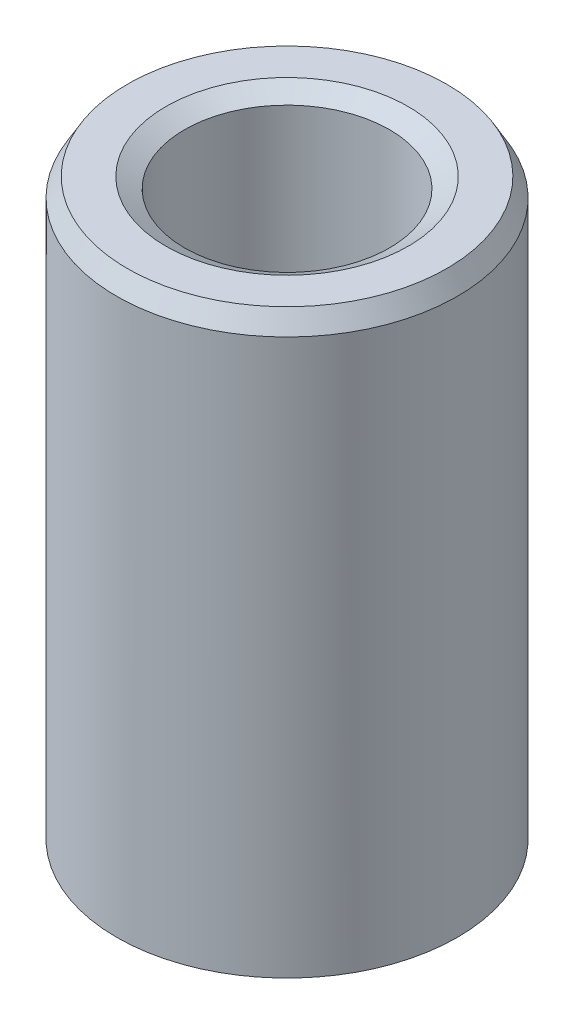
ISO-10303-21;
HEADER;
FILE_DESCRIPTION(('STEP AP214'),'2;1');
FILE_NAME('part.step','',(''),(''),'','','');
FILE_SCHEMA(('AUTOMOTIVE_DESIGN { 1 0 10303 214 1 1 1 1 }'));
ENDSEC;
DATA;
#1=APPLICATION_CONTEXT('core data for automotive mechanical design processes');
#2=APPLICATION_PROTOCOL_DEFINITION('international standard','automotive_design',2000,#1);
#3=PRODUCT_CONTEXT('',#1,'mechanical');
#4=PRODUCT('Part','Part','',(#3));
#5=PRODUCT_RELATED_PRODUCT_CATEGORY('part','',(#4));
#6=PRODUCT_DEFINITION_FORMATION('','',#4);
#7=PRODUCT_DEFINITION_CONTEXT('part definition',#1,'design');
#8=PRODUCT_DEFINITION('design','',#6,#7);
#9=PRODUCT_DEFINITION_SHAPE('','',#8);
#10=(LENGTH_UNIT() NAMED_UNIT(*) SI_UNIT(.MILLI.,.METRE.));
#11=(NAMED_UNIT(*) PLANE_ANGLE_UNIT() SI_UNIT($,.RADIAN.));
#12=(NAMED_UNIT(*) SI_UNIT($,.STERADIAN.) SOLID_ANGLE_UNIT());
#13=UNCERTAINTY_MEASURE_WITH_UNIT(LENGTH_MEASURE(1.E-05),#10,'distance_accuracy_value','');
#14=(GEOMETRIC_REPRESENTATION_CONTEXT(3) GLOBAL_UNCERTAINTY_ASSIGNED_CONTEXT((#13)) GLOBAL_UNIT_ASSIGNED_CONTEXT((#10,
#11,#12)) REPRESENTATION_CONTEXT('',''));
#15=CARTESIAN_POINT('',(0.,0.,0.));
#16=DIRECTION('',(0.,0.,1.));
#17=DIRECTION('',(1.,0.,0.));
#18=AXIS2_PLACEMENT_3D('',#15,#16,#17);
#19=CARTESIAN_POINT('',(0.,111.46514379659,0.));
#20=DIRECTION('',(0.,-1.,0.));
#21=DIRECTION('',(0.,0.,-1.));
#22=AXIS2_PLACEMENT_3D('',#19,#20,#21);
#23=CYLINDRICAL_SURFACE('',#22,32.5);
#24=CARTESIAN_POINT('',(0.,2.04900109820265,0.));
#25=DIRECTION('',(0.,1.,0.));
#26=DIRECTION('',(0.,0.,1.));
#27=AXIS2_PLACEMENT_3D('',#24,#25,#26);
#28=CIRCLE('',#27,32.5);
#29=CARTESIAN_POINT('',(0.,2.04900109820265,32.5));
#30=VERTEX_POINT('',#29);
#31=EDGE_CURVE('E10',#30,#30,#28,.T.);
#32=ORIENTED_EDGE('',*,*,#31,.T.);
#33=EDGE_LOOP('',(#32));
#34=FACE_BOUND('',#33,.T.);
#35=CARTESIAN_POINT('',(0.,107.916169789739,0.));
#36=DIRECTION('',(0.,1.,0.));
#37=DIRECTION('',(0.,0.,1.));
#38=AXIS2_PLACEMENT_3D('',#35,#36,#37);
#39=CIRCLE('',#38,32.5);
#40=CARTESIAN_POINT('',(0.,107.916169789739,-32.5));
#41=VERTEX_POINT('',#40);
#42=EDGE_CURVE('E50',#41,#41,#39,.F.);
#43=ORIENTED_EDGE('',*,*,#42,.T.);
#44=EDGE_LOOP('',(#43));
#45=FACE_BOUND('',#44,.T.);
#46=ADVANCED_FACE('F39',(#34,#45),#23,.T.);
#47=CARTESIAN_POINT('',(0.,111.46514379659,0.));
#48=DIRECTION('',(0.,1.,0.));
#49=DIRECTION('',(0.,0.,1.));
#50=AXIS2_PLACEMENT_3D('',#47,#48,#49);
#51=PLANE('',#50);
#52=CARTESIAN_POINT('',(0.,111.46514379659,0.));
#53=DIRECTION('',(0.,1.,0.));
#54=DIRECTION('',(0.,0.,1.));
#55=AXIS2_PLACEMENT_3D('',#52,#53,#54);
#56=CIRCLE('',#55,23.0939143873798);
#57=CARTESIAN_POINT('',(0.,111.46514379659,23.0939143873798));
#58=VERTEX_POINT('',#57);
#59=EDGE_CURVE('E58',#58,#58,#56,.F.);
#60=ORIENTED_EDGE('',*,*,#59,.T.);
#61=EDGE_LOOP('',(#60));
#62=FACE_BOUND('',#61,.T.);
#63=CARTESIAN_POINT('',(0.,111.46514379659,0.));
#64=DIRECTION('',(0.,1.,0.));
#65=DIRECTION('',(0.,0.,1.));
#66=AXIS2_PLACEMENT_3D('',#63,#64,#65);
#67=CIRCLE('',#66,30.4509989017974);
#68=CARTESIAN_POINT('',(0.,111.46514379659,-30.4509989017974));
#69=VERTEX_POINT('',#68);
#70=EDGE_CURVE('E61',#69,#69,#67,.T.);
#71=ORIENTED_EDGE('',*,*,#70,.T.);
#72=EDGE_LOOP('',(#71));
#73=FACE_BOUND('',#72,.T.);
#74=ADVANCED_FACE('F88',(#62,#73),#51,.T.);
#75=CARTESIAN_POINT('',(0.,0.,0.));
#76=DIRECTION('',(0.,1.,0.));
#77=DIRECTION('',(0.,0.,1.));
#78=AXIS2_PLACEMENT_3D('',#75,#76,#77);
#79=PLANE('',#78);
#80=CARTESIAN_POINT('',(0.,0.,0.));
#81=DIRECTION('',(0.,1.,0.));
#82=DIRECTION('',(0.,0.,1.));
#83=AXIS2_PLACEMENT_3D('',#80,#81,#82);
#84=CIRCLE('',#83,21.5939414787309);
#85=CARTESIAN_POINT('',(0.,0.,21.5939414787309));
#86=VERTEX_POINT('',#85);
#87=EDGE_CURVE('E51',#86,#86,#84,.T.);
#88=ORIENTED_EDGE('',*,*,#87,.T.);
#89=EDGE_LOOP('',(#88));
#90=FACE_BOUND('',#89,.T.);
#91=CARTESIAN_POINT('',(0.,0.,0.));
#92=DIRECTION('',(0.,1.,0.));
#93=DIRECTION('',(0.,0.,1.));
#94=AXIS2_PLACEMENT_3D('',#91,#92,#93);
#95=CIRCLE('',#94,28.9510259931486);
#96=CARTESIAN_POINT('',(0.,0.,28.9510259931486));
#97=VERTEX_POINT('',#96);
#98=EDGE_CURVE('E54',#97,#97,#95,.F.);
#99=ORIENTED_EDGE('',*,*,#98,.T.);
#100=EDGE_LOOP('',(#99));
#101=FACE_BOUND('',#100,.T.);
#102=ADVANCED_FACE('F83',(#90,#101),#79,.F.);
#103=CARTESIAN_POINT('',(0.,111.46514379659,0.));
#104=DIRECTION('',(0.,-1.,0.));
#105=DIRECTION('',(0.,0.,-1.));
#106=AXIS2_PLACEMENT_3D('',#103,#104,#105);
#107=CYLINDRICAL_SURFACE('',#106,19.5449403805283);
#108=CARTESIAN_POINT('',(0.,109.416142698387,0.));
#109=DIRECTION('',(0.,1.,0.));
#110=DIRECTION('',(0.,0.,1.));
#111=AXIS2_PLACEMENT_3D('',#108,#109,#110);
#112=CIRCLE('',#111,19.5449403805283);
#113=CARTESIAN_POINT('',(0.,109.416142698387,19.5449403805283));
#114=VERTEX_POINT('',#113);
#115=EDGE_CURVE('E67',#114,#114,#112,.T.);
#116=ORIENTED_EDGE('',*,*,#115,.T.);
#117=EDGE_LOOP('',(#116));
#118=FACE_BOUND('',#117,.T.);
#119=CARTESIAN_POINT('',(0.,3.54897400685143,0.));
#120=DIRECTION('',(0.,1.,0.));
#121=DIRECTION('',(0.,0.,1.));
#122=AXIS2_PLACEMENT_3D('',#119,#120,#121);
#123=CIRCLE('',#122,19.5449403805283);
#124=CARTESIAN_POINT('',(0.,3.54897400685143,19.5449403805283));
#125=VERTEX_POINT('',#124);
#126=EDGE_CURVE('E69',#125,#125,#123,.F.);
#127=ORIENTED_EDGE('',*,*,#126,.T.);
#128=EDGE_LOOP('',(#127));
#129=FACE_BOUND('',#128,.T.);
#130=ADVANCED_FACE('F71',(#118,#129),#107,.F.);
#131=CARTESIAN_POINT('',(0.,109.416142698387,0.));
#132=DIRECTION('',(0.,1.,0.));
#133=DIRECTION('',(0.,0.,1.));
#134=AXIS2_PLACEMENT_3D('',#131,#132,#133);
#135=CONICAL_SURFACE('',#134,19.5449403805283,1.0471975511966);
#136=ORIENTED_EDGE('',*,*,#59,.F.);
#137=EDGE_LOOP('',(#136));
#138=FACE_BOUND('',#137,.T.);
#139=ORIENTED_EDGE('',*,*,#115,.F.);
#140=EDGE_LOOP('',(#139));
#141=FACE_BOUND('',#140,.T.);
#142=ADVANCED_FACE('F77',(#138,#141),#135,.F.);
#143=CARTESIAN_POINT('',(0.,0.,0.));
#144=DIRECTION('',(0.,-1.,0.));
#145=DIRECTION('',(0.,0.,-1.));
#146=AXIS2_PLACEMENT_3D('',#143,#144,#145);
#147=CONICAL_SURFACE('',#146,21.5939414787309,0.523598775598295);
#148=ORIENTED_EDGE('',*,*,#126,.F.);
#149=EDGE_LOOP('',(#148));
#150=FACE_BOUND('',#149,.T.);
#151=ORIENTED_EDGE('',*,*,#87,.F.);
#152=EDGE_LOOP('',(#151));
#153=FACE_BOUND('',#152,.T.);
#154=ADVANCED_FACE('F73',(#150,#153),#147,.F.);
#155=CARTESIAN_POINT('',(0.,2.04900109820265,0.));
#156=DIRECTION('',(0.,1.,0.));
#157=DIRECTION('',(0.,0.,1.));
#158=AXIS2_PLACEMENT_3D('',#155,#156,#157);
#159=CONICAL_SURFACE('',#158,32.5,1.0471975511966);
#160=ORIENTED_EDGE('',*,*,#98,.F.);
#161=EDGE_LOOP('',(#160));
#162=FACE_BOUND('',#161,.T.);
#163=ORIENTED_EDGE('',*,*,#31,.F.);
#164=EDGE_LOOP('',(#163));
#165=FACE_BOUND('',#164,.T.);
#166=ADVANCED_FACE('F76',(#162,#165),#159,.T.);
#167=CARTESIAN_POINT('',(0.,111.46514379659,0.));
#168=DIRECTION('',(0.,-1.,0.));
#169=DIRECTION('',(0.,0.,-1.));
#170=AXIS2_PLACEMENT_3D('',#167,#168,#169);
#171=CONICAL_SURFACE('',#170,30.4509989017974,0.523598775598295);
#172=CARTESIAN_POINT('',(0.,107.916169789739,-32.5));
#173=CARTESIAN_POINT('',(0.,107.953138268977,-32.4786562385604));
#174=CARTESIAN_POINT('',(0.,107.990106748215,-32.4573124771208));
#175=CARTESIAN_POINT('',(0.,108.064043706691,-32.4146249542416));
#176=CARTESIAN_POINT('',(0.,108.101012185929,-32.393281192802));
#177=CARTESIAN_POINT('',(0.,108.174949144405,-32.3505936699227));
#178=CARTESIAN_POINT('',(0.,108.211917623643,-32.3292499084831));
#179=CARTESIAN_POINT('',(0.,108.285854582119,-32.2865623856039));
#180=CARTESIAN_POINT('',(0.,108.322823061357,-32.2652186241643));
#181=CARTESIAN_POINT('',(0.,108.396760019833,-32.2225311012851));
#182=CARTESIAN_POINT('',(0.,108.433728499071,-32.2011873398455));
#183=CARTESIAN_POINT('',(0.,108.507665457547,-32.1584998169662));
#184=CARTESIAN_POINT('',(0.,108.544633936785,-32.1371560555266));
#185=CARTESIAN_POINT('',(0.,108.618570895261,-32.0944685326474));
#186=CARTESIAN_POINT('',(0.,108.655539374499,-32.0731247712078));
#187=CARTESIAN_POINT('',(0.,108.729476332975,-32.0304372483286));
#188=CARTESIAN_POINT('',(0.,108.766444812214,-32.009093486889));
#189=CARTESIAN_POINT('',(0.,108.84038177069,-31.9664059640097));
#190=CARTESIAN_POINT('',(0.,108.877350249928,-31.9450622025701));
#191=CARTESIAN_POINT('',(0.,108.951287208404,-31.9023746796909));
#192=CARTESIAN_POINT('',(0.,108.988255687642,-31.8810309182513));
#193=CARTESIAN_POINT('',(0.,109.062192646118,-31.8383433953721));
#194=CARTESIAN_POINT('',(0.,109.099161125356,-31.8169996339325));
#195=CARTESIAN_POINT('',(0.,109.173098083832,-31.7743121110532));
#196=CARTESIAN_POINT('',(0.,109.21006656307,-31.7529683496136));
#197=CARTESIAN_POINT('',(0.,109.284003521546,-31.7102808267344));
#198=CARTESIAN_POINT('',(0.,109.320972000784,-31.6889370652948));
#199=CARTESIAN_POINT('',(0.,109.39490895926,-31.6462495424156));
#200=CARTESIAN_POINT('',(0.,109.431877438498,-31.624905780976));
#201=CARTESIAN_POINT('',(0.,109.505814396974,-31.5822182580967));
#202=CARTESIAN_POINT('',(0.,109.542782876212,-31.5608744966571));
#203=CARTESIAN_POINT('',(0.,109.616719834688,-31.5181869737779));
#204=CARTESIAN_POINT('',(0.,109.653688313926,-31.4968432123383));
#205=CARTESIAN_POINT('',(0.,109.727625272402,-31.4541556894591));
#206=CARTESIAN_POINT('',(0.,109.76459375164,-31.4328119280195));
#207=CARTESIAN_POINT('',(0.,109.838530710117,-31.3901244051402));
#208=CARTESIAN_POINT('',(0.,109.875499189355,-31.3687806437006));
#209=CARTESIAN_POINT('',(0.,109.949436147831,-31.3260931208214));
#210=CARTESIAN_POINT('',(0.,109.986404627069,-31.3047493593818));
#211=CARTESIAN_POINT('',(0.,110.060341585545,-31.2620618365026));
#212=CARTESIAN_POINT('',(0.,110.097310064783,-31.240718075063));
#213=CARTESIAN_POINT('',(0.,110.171247023259,-31.1980305521837));
#214=CARTESIAN_POINT('',(0.,110.208215502497,-31.1766867907441));
#215=CARTESIAN_POINT('',(0.,110.282152460973,-31.1339992678649));
#216=CARTESIAN_POINT('',(0.,110.319120940211,-31.1126555064253));
#217=CARTESIAN_POINT('',(0.,110.393057898687,-31.0699679835461));
#218=CARTESIAN_POINT('',(0.,110.430026377925,-31.0486242221065));
#219=CARTESIAN_POINT('',(0.,110.503963336401,-31.0059366992273));
#220=CARTESIAN_POINT('',(0.,110.540931815639,-30.9845929377876));
#221=CARTESIAN_POINT('',(0.,110.614868774115,-30.9419054149084));
#222=CARTESIAN_POINT('',(0.,110.651837253353,-30.9205616534688));
#223=CARTESIAN_POINT('',(0.,110.725774211829,-30.8778741305896));
#224=CARTESIAN_POINT('',(0.,110.762742691067,-30.85653036915));
#225=CARTESIAN_POINT('',(0.,110.836679649544,-30.8138428462708));
#226=CARTESIAN_POINT('',(0.,110.873648128782,-30.7924990848311));
#227=CARTESIAN_POINT('',(0.,110.947585087258,-30.7498115619519));
#228=CARTESIAN_POINT('',(0.,110.984553566496,-30.7284678005123));
#229=CARTESIAN_POINT('',(0.,111.058490524972,-30.6857802776331));
#230=CARTESIAN_POINT('',(0.,111.09545900421,-30.6644365161935));
#231=CARTESIAN_POINT('',(0.,111.169395962686,-30.6217489933143));
#232=CARTESIAN_POINT('',(0.,111.206364441924,-30.6004052318746));
#233=CARTESIAN_POINT('',(0.,111.2803014004,-30.5577177089954));
#234=CARTESIAN_POINT('',(0.,111.317269879638,-30.5363739475558));
#235=CARTESIAN_POINT('',(0.,111.391206838114,-30.4936864246766));
#236=CARTESIAN_POINT('',(0.,111.428175317352,-30.472342663237));
#237=CARTESIAN_POINT('',(0.,111.46514379659,-30.4509989017974));
#238=B_SPLINE_CURVE_WITH_KNOTS('',3,(#172,#173,#174,#175,#176,#177,#178,#179,#180,#181,#182,
#183,#184,#185,#186,#187,#188,#189,#190,#191,#192,#193,#194,#195,#196,#197,#198,#199,#200,#201,
#202,#203,#204,#205,#206,#207,#208,#209,#210,#211,#212,#213,#214,#215,#216,#217,#218,#219,#220,
#221,#222,#223,#224,#225,#226,#227,#228,#229,#230,#231,#232,#233,#234,#235,#236,#237),
.UNSPECIFIED.,.F.,.F.,(4,2,2,2,2,2,2,2,2,2,2,2,2,2,2,2,2,2,2,2,2,2,2,2,2,2,2,2,2,2,2,2,4),(0.,
0.128062568637667,0.256125137275338,0.384187705913005,0.512250274550673,0.64031284318834,
0.768375411825995,0.896437980463662,1.02450054910133,1.152563117739,1.28062568637667,
1.40868825501432,1.53675082365199,1.66481339228966,1.79287596092732,1.92093852956499,
2.04900109820265,2.17706366684031,2.30512623547799,2.43318880411565,2.56125137275332,
2.68931394139099,2.81737651002864,2.94543907866631,3.07350164730398,3.20156421594165,
3.32962678457931,3.45768935321697,3.58575192185464,3.7138144904923,3.84187705912997,
3.96993962776764,4.09800219640531),.UNSPECIFIED.);
#239=EDGE_CURVE('BSEAM45',#41,#69,#238,.T.);
#240=ORIENTED_EDGE('',*,*,#42,.F.);
#241=ORIENTED_EDGE('',*,*,#70,.F.);
#242=ORIENTED_EDGE('',*,*,#239,.T.);
#243=ORIENTED_EDGE('',*,*,#239,.F.);
#244=EDGE_LOOP('',(#240,#242,#241,#243));
#245=FACE_BOUND('',#244,.T.);
#246=ADVANCED_FACE('F45',(#245),#171,.T.);
#247=CLOSED_SHELL('',(#46,#74,#102,#130,#142,#154,#166,#246));
#248=MANIFOLD_SOLID_BREP('B2',#247);
#249=ADVANCED_BREP_SHAPE_REPRESENTATION('',(#18,#248),#14);
#250=SHAPE_DEFINITION_REPRESENTATION(#9,#249);
ENDSEC;
END-ISO-10303-21;
